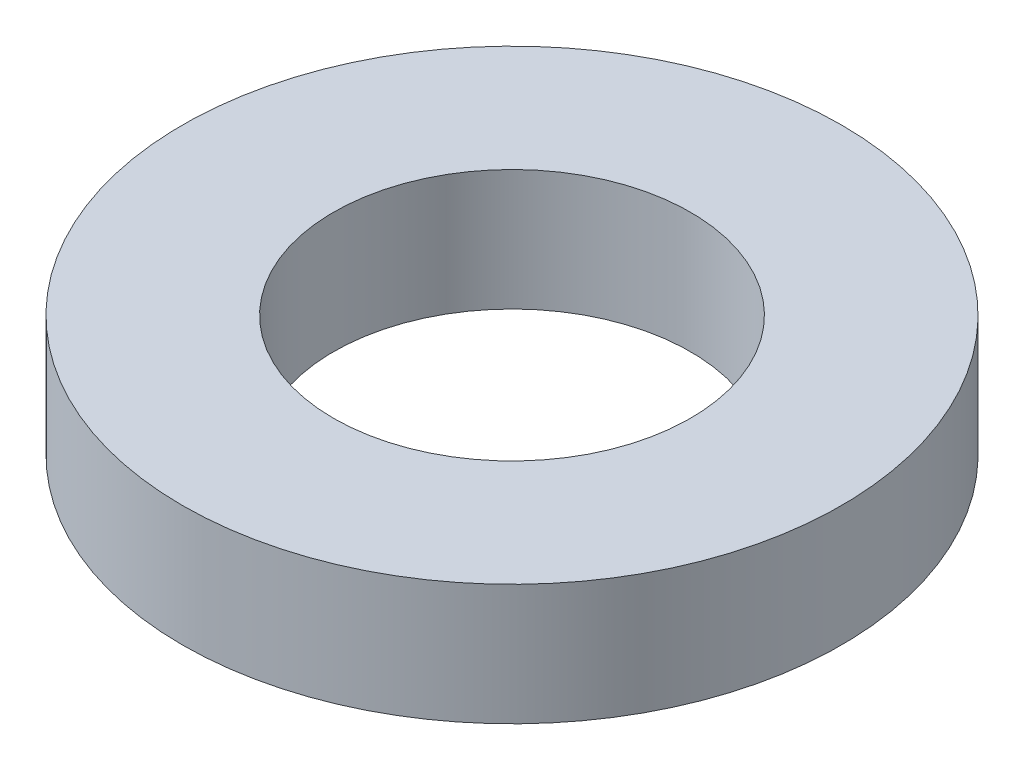
ISO-10303-21;
HEADER;
FILE_DESCRIPTION(('STEP AP214'),'2;1');
FILE_NAME('part.step','',(''),(''),'','','');
FILE_SCHEMA(('AUTOMOTIVE_DESIGN { 1 0 10303 214 1 1 1 1 }'));
ENDSEC;
DATA;
#1=APPLICATION_CONTEXT('core data for automotive mechanical design processes');
#2=APPLICATION_PROTOCOL_DEFINITION('international standard','automotive_design',2000,#1);
#3=PRODUCT_CONTEXT('',#1,'mechanical');
#4=PRODUCT('Part','Part','',(#3));
#5=PRODUCT_RELATED_PRODUCT_CATEGORY('part','',(#4));
#6=PRODUCT_DEFINITION_FORMATION('','',#4);
#7=PRODUCT_DEFINITION_CONTEXT('part definition',#1,'design');
#8=PRODUCT_DEFINITION('design','',#6,#7);
#9=PRODUCT_DEFINITION_SHAPE('','',#8);
#10=(LENGTH_UNIT() NAMED_UNIT(*) SI_UNIT(.MILLI.,.METRE.));
#11=(NAMED_UNIT(*) PLANE_ANGLE_UNIT() SI_UNIT($,.RADIAN.));
#12=(NAMED_UNIT(*) SI_UNIT($,.STERADIAN.) SOLID_ANGLE_UNIT());
#13=UNCERTAINTY_MEASURE_WITH_UNIT(LENGTH_MEASURE(1.E-05),#10,'distance_accuracy_value','');
#14=(GEOMETRIC_REPRESENTATION_CONTEXT(3) GLOBAL_UNCERTAINTY_ASSIGNED_CONTEXT((#13)) GLOBAL_UNIT_ASSIGNED_CONTEXT((#10,
#11,#12)) REPRESENTATION_CONTEXT('',''));
#15=CARTESIAN_POINT('',(0.,0.,0.));
#16=DIRECTION('',(0.,0.,1.));
#17=DIRECTION('',(1.,0.,0.));
#18=AXIS2_PLACEMENT_3D('',#15,#16,#17);
#19=CARTESIAN_POINT('',(0.,22.,0.));
#20=DIRECTION('',(0.,1.,0.));
#21=DIRECTION('',(0.,0.,1.));
#22=AXIS2_PLACEMENT_3D('',#19,#20,#21);
#23=PLANE('',#22);
#24=CARTESIAN_POINT('',(0.,22.,0.));
#25=DIRECTION('',(0.,1.,0.));
#26=DIRECTION('',(0.,0.,1.));
#27=AXIS2_PLACEMENT_3D('',#24,#25,#26);
#28=CIRCLE('',#27,60.);
#29=CARTESIAN_POINT('',(0.,22.,60.));
#30=VERTEX_POINT('',#29);
#31=EDGE_CURVE('E10',#30,#30,#28,.T.);
#32=ORIENTED_EDGE('',*,*,#31,.T.);
#33=EDGE_LOOP('',(#32));
#34=FACE_BOUND('',#33,.T.);
#35=CARTESIAN_POINT('',(0.,22.,0.));
#36=DIRECTION('',(0.,1.,0.));
#37=DIRECTION('',(0.,0.,1.));
#38=AXIS2_PLACEMENT_3D('',#35,#36,#37);
#39=CIRCLE('',#38,32.5);
#40=CARTESIAN_POINT('',(0.,22.,32.5));
#41=VERTEX_POINT('',#40);
#42=EDGE_CURVE('E54',#41,#41,#39,.T.);
#43=ORIENTED_EDGE('',*,*,#42,.F.);
#44=EDGE_LOOP('',(#43));
#45=FACE_BOUND('',#44,.T.);
#46=ADVANCED_FACE('F41',(#34,#45),#23,.T.);
#47=CARTESIAN_POINT('',(0.,0.,0.));
#48=DIRECTION('',(0.,1.,0.));
#49=DIRECTION('',(0.,0.,1.));
#50=AXIS2_PLACEMENT_3D('',#47,#48,#49);
#51=PLANE('',#50);
#52=CARTESIAN_POINT('',(0.,0.,0.));
#53=DIRECTION('',(0.,1.,0.));
#54=DIRECTION('',(0.,0.,1.));
#55=AXIS2_PLACEMENT_3D('',#52,#53,#54);
#56=CIRCLE('',#55,60.);
#57=CARTESIAN_POINT('',(0.,0.,60.));
#58=VERTEX_POINT('',#57);
#59=EDGE_CURVE('E45',#58,#58,#56,.T.);
#60=ORIENTED_EDGE('',*,*,#59,.F.);
#61=EDGE_LOOP('',(#60));
#62=FACE_BOUND('',#61,.T.);
#63=CARTESIAN_POINT('',(0.,0.,0.));
#64=DIRECTION('',(0.,1.,0.));
#65=DIRECTION('',(0.,0.,1.));
#66=AXIS2_PLACEMENT_3D('',#63,#64,#65);
#67=CIRCLE('',#66,32.5);
#68=CARTESIAN_POINT('',(0.,0.,32.5));
#69=VERTEX_POINT('',#68);
#70=EDGE_CURVE('E56',#69,#69,#67,.T.);
#71=ORIENTED_EDGE('',*,*,#70,.T.);
#72=EDGE_LOOP('',(#71));
#73=FACE_BOUND('',#72,.T.);
#74=ADVANCED_FACE('F68',(#62,#73),#51,.F.);
#75=CARTESIAN_POINT('',(0.,22.,0.));
#76=DIRECTION('',(0.,-1.,0.));
#77=DIRECTION('',(0.,0.,-1.));
#78=AXIS2_PLACEMENT_3D('',#75,#76,#77);
#79=CYLINDRICAL_SURFACE('',#78,60.);
#80=ORIENTED_EDGE('',*,*,#31,.F.);
#81=EDGE_LOOP('',(#80));
#82=FACE_BOUND('',#81,.T.);
#83=ORIENTED_EDGE('',*,*,#59,.T.);
#84=EDGE_LOOP('',(#83));
#85=FACE_BOUND('',#84,.T.);
#86=ADVANCED_FACE('F43',(#82,#85),#79,.T.);
#87=CARTESIAN_POINT('',(0.,22.,0.));
#88=DIRECTION('',(0.,-1.,0.));
#89=DIRECTION('',(0.,0.,-1.));
#90=AXIS2_PLACEMENT_3D('',#87,#88,#89);
#91=CYLINDRICAL_SURFACE('',#90,32.5);
#92=ORIENTED_EDGE('',*,*,#42,.T.);
#93=EDGE_LOOP('',(#92));
#94=FACE_BOUND('',#93,.T.);
#95=ORIENTED_EDGE('',*,*,#70,.F.);
#96=EDGE_LOOP('',(#95));
#97=FACE_BOUND('',#96,.T.);
#98=ADVANCED_FACE('F64',(#94,#97),#91,.F.);
#99=CLOSED_SHELL('',(#46,#74,#86,#98));
#100=MANIFOLD_SOLID_BREP('B2',#99);
#101=ADVANCED_BREP_SHAPE_REPRESENTATION('',(#18,#100),#14);
#102=SHAPE_DEFINITION_REPRESENTATION(#9,#101);
ENDSEC;
END-ISO-10303-21;
